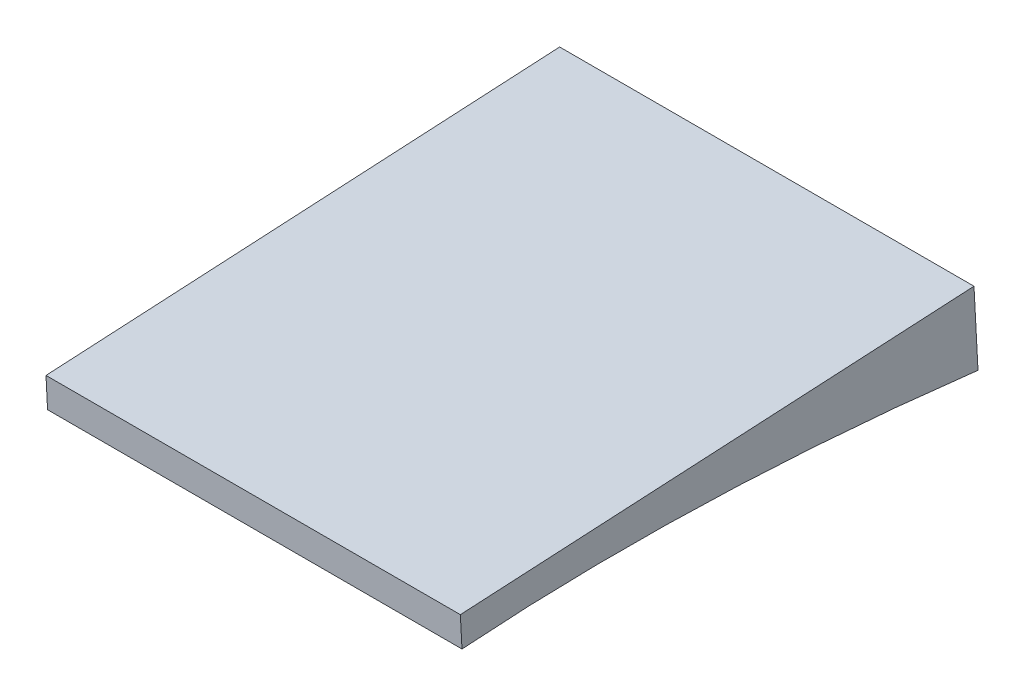
ISO-10303-21;
HEADER;
FILE_DESCRIPTION(('STEP AP214'),'2;1');
FILE_NAME('part.step','',(''),(''),'','','');
FILE_SCHEMA(('AUTOMOTIVE_DESIGN { 1 0 10303 214 1 1 1 1 }'));
ENDSEC;
DATA;
#1=APPLICATION_CONTEXT('core data for automotive mechanical design processes');
#2=APPLICATION_PROTOCOL_DEFINITION('international standard','automotive_design',2000,#1);
#3=PRODUCT_CONTEXT('',#1,'mechanical');
#4=PRODUCT('Part','Part','',(#3));
#5=PRODUCT_RELATED_PRODUCT_CATEGORY('part','',(#4));
#6=PRODUCT_DEFINITION_FORMATION('','',#4);
#7=PRODUCT_DEFINITION_CONTEXT('part definition',#1,'design');
#8=PRODUCT_DEFINITION('design','',#6,#7);
#9=PRODUCT_DEFINITION_SHAPE('','',#8);
#10=(LENGTH_UNIT() NAMED_UNIT(*) SI_UNIT(.MILLI.,.METRE.));
#11=(NAMED_UNIT(*) PLANE_ANGLE_UNIT() SI_UNIT($,.RADIAN.));
#12=(NAMED_UNIT(*) SI_UNIT($,.STERADIAN.) SOLID_ANGLE_UNIT());
#13=UNCERTAINTY_MEASURE_WITH_UNIT(LENGTH_MEASURE(1.E-05),#10,'distance_accuracy_value','');
#14=(GEOMETRIC_REPRESENTATION_CONTEXT(3) GLOBAL_UNCERTAINTY_ASSIGNED_CONTEXT((#13)) GLOBAL_UNIT_ASSIGNED_CONTEXT((#10,
#11,#12)) REPRESENTATION_CONTEXT('',''));
#15=CARTESIAN_POINT('',(0.,0.,0.));
#16=DIRECTION('',(0.,0.,1.));
#17=DIRECTION('',(1.,0.,0.));
#18=AXIS2_PLACEMENT_3D('',#15,#16,#17);
#19=CARTESIAN_POINT('',(-177.805848873745,-43.688210722732,-115.550179040921));
#20=DIRECTION('',(-2.29475219963646E-07,0.0534934907984705,-0.998568198192863));
#21=DIRECTION('',(0.,0.99856819819289,0.053493490798472));
#22=AXIS2_PLACEMENT_3D('',#19,#20,#21);
#23=PLANE('',#22);
#24=CARTESIAN_POINT('',(-177.8,74.4222867999415,-109.222976930415));
#25=CARTESIAN_POINT('',(-204.737386779382,74.4223060552666,-109.222969708578));
#26=CARTESIAN_POINT('',(-231.674773558716,74.4222945833738,-109.222964132803));
#27=CARTESIAN_POINT('',(-285.549547117384,74.4222101851525,-109.22295627338));
#28=CARTESIAN_POINT('',(-312.486933896718,74.4221372588239,-109.222953989731));
#29=CARTESIAN_POINT('',(-339.424320676004,74.4220336052774,-109.222953352146));
#30=B_SPLINE_CURVE_WITH_KNOTS('',3,(#24,#25,#26,#27,#28,#29),.UNSPECIFIED.,.F.,.F.,(4,2,4),(0.,
80.8121603380111,161.62432067631),.UNSPECIFIED.);
#31=CARTESIAN_POINT('',(-177.8,74.4222867999415,-109.222976930415));
#32=VERTEX_POINT('',#31);
#33=CARTESIAN_POINT('',(-338.178267081434,74.4220392812835,-109.222953334429));
#34=VERTEX_POINT('',#33);
#35=EDGE_CURVE('E105',#32,#34,#30,.T.);
#36=ORIENTED_EDGE('',*,*,#35,.T.);
#37=DIRECTION('',(0.0023746530409731,0.998565382766486,0.0534933394298316));
#38=VECTOR('',#37,1.);
#39=CARTESIAN_POINT('',(-338.458234976646,-43.3072641668652,-115.529734741914));
#40=LINE('',#39,#38);
#41=CARTESIAN_POINT('',(-338.20642601368,62.5809262970695,-109.857284032272));
#42=VERTEX_POINT('',#41);
#43=EDGE_CURVE('E11',#42,#34,#40,.T.);
#44=ORIENTED_EDGE('',*,*,#43,.F.);
#45=CARTESIAN_POINT('',(-339.424320676004,62.5809262763675,-109.857283753503));
#46=CARTESIAN_POINT('',(-285.549547117336,62.5809271921398,-109.857296085097));
#47=CARTESIAN_POINT('',(-231.674773558668,62.5809281079121,-109.857308416692));
#48=CARTESIAN_POINT('',(-177.8,62.5809290236845,-109.857320748286));
#49=B_SPLINE_CURVE_WITH_KNOTS('',3,(#45,#46,#47,#48),.UNSPECIFIED.,.F.,.F.,(4,4),(0.,
161.624320676009),.UNSPECIFIED.);
#50=CARTESIAN_POINT('',(-177.8,62.5809290234087,-109.857320744572));
#51=VERTEX_POINT('',#50);
#52=EDGE_CURVE('E103',#42,#51,#49,.T.);
#53=ORIENTED_EDGE('',*,*,#52,.T.);
#54=DIRECTION('',(0.,-0.99856819819289,-0.053493490798472));
#55=VECTOR('',#54,1.);
#56=CARTESIAN_POINT('',(-177.8,6.04731605634461,-112.885837288814));
#57=LINE('',#56,#55);
#58=EDGE_CURVE('E90',#32,#51,#57,.T.);
#59=ORIENTED_EDGE('',*,*,#58,.F.);
#60=EDGE_LOOP('',(#36,#44,#53,#59));
#61=FACE_BOUND('',#60,.T.);
#62=ADVANCED_FACE('F42',(#61),#23,.F.);
#63=CARTESIAN_POINT('',(-177.805940246243,-33.0381702413849,-314.355519034823));
#64=DIRECTION('',(-2.29475219526301E-07,0.0534934907984705,-0.998568198192863));
#65=DIRECTION('',(0.,0.99856819819289,0.053493490798472));
#66=AXIS2_PLACEMENT_3D('',#63,#64,#65);
#67=PLANE('',#66);
#68=CARTESIAN_POINT('',(-177.8,85.110750331542,-308.026258594133));
#69=CARTESIAN_POINT('',(-204.737394348035,85.1107449085178,-308.026252694317));
#70=CARTESIAN_POINT('',(-231.674788696068,85.1107454911889,-308.026246472776));
#71=CARTESIAN_POINT('',(-285.549577392135,85.1107586679218,-308.02623338624));
#72=CARTESIAN_POINT('',(-312.486971740168,85.1107712619836,-308.026226521246));
#73=CARTESIAN_POINT('',(-339.4243660882,85.1107898617407,-308.026219334526));
#74=B_SPLINE_CURVE_WITH_KNOTS('',3,(#68,#69,#70,#71,#72,#73),.UNSPECIFIED.,.F.,.F.,(4,2,4),(0.,
80.8121830441022,161.624366088213),.UNSPECIFIED.);
#75=CARTESIAN_POINT('',(-177.8,85.110750331542,-308.026258594133));
#76=VERTEX_POINT('',#75);
#77=CARTESIAN_POINT('',(-338.178220714968,85.1107887697366,-308.026219679411));
#78=VERTEX_POINT('',#77);
#79=EDGE_CURVE('E70',#76,#78,#74,.T.);
#80=ORIENTED_EDGE('',*,*,#79,.F.);
#81=DIRECTION('',(0.,-0.99856819819289,-0.053493490798472));
#82=VECTOR('',#81,1.);
#83=CARTESIAN_POINT('',(-177.8,16.697356429359,-311.691177288541));
#84=LINE('',#83,#82);
#85=CARTESIAN_POINT('',(-177.8,56.1511791040107,-309.577628401668));
#86=VERTEX_POINT('',#85);
#87=EDGE_CURVE('E100',#76,#86,#84,.T.);
#88=ORIENTED_EDGE('',*,*,#87,.T.);
#89=CARTESIAN_POINT('',(-339.4243660882,56.15118359318,-309.577591022767));
#90=CARTESIAN_POINT('',(-285.549577392133,56.1511820966472,-309.577603483592));
#91=CARTESIAN_POINT('',(-231.674788696067,56.1511806001143,-309.577615944417));
#92=CARTESIAN_POINT('',(-177.8,56.1511791035814,-309.577628405242));
#93=B_SPLINE_CURVE_WITH_KNOTS('',3,(#89,#90,#91,#92),.UNSPECIFIED.,.F.,.F.,(4,4),(0.,
161.624366088204),.UNSPECIFIED.);
#94=CARTESIAN_POINT('',(-338.247088528495,56.1511835604797,-309.577591295045));
#95=VERTEX_POINT('',#94);
#96=EDGE_CURVE('E63',#95,#86,#93,.T.);
#97=ORIENTED_EDGE('',*,*,#96,.F.);
#98=DIRECTION('',(0.0023746530409731,0.998565382766486,0.0534933394298316));
#99=VECTOR('',#98,1.);
#100=CARTESIAN_POINT('',(-338.458280662959,-32.6572237938514,-314.335074741631));
#101=LINE('',#100,#99);
#102=EDGE_CURVE('E106',#95,#78,#101,.T.);
#103=ORIENTED_EDGE('',*,*,#102,.T.);
#104=EDGE_LOOP('',(#80,#88,#97,#103));
#105=FACE_BOUND('',#104,.T.);
#106=ADVANCED_FACE('F141',(#105),#67,.T.);
#107=CARTESIAN_POINT('',(-338.458280662959,-32.6572237938514,-314.335074741631));
#108=DIRECTION('',(-0.999997180507466,0.0023712407330619,0.000127257626607295));
#109=DIRECTION('',(-0.00237124075226243,-0.999997188604695,0.));
#110=AXIS2_PLACEMENT_3D('',#107,#108,#109);
#111=PLANE('',#110);
#112=CARTESIAN_POINT('',(-338.178219534104,85.3830238830238,-313.089602884485));
#113=CARTESIAN_POINT('',(-338.178235622091,81.6742972710218,-244.109881178541));
#114=CARTESIAN_POINT('',(-338.178251710078,77.9655706590198,-175.130159472598));
#115=CARTESIAN_POINT('',(-338.178267798066,74.2568440470178,-106.150437766654));
#116=B_SPLINE_CURVE_WITH_KNOTS('',3,(#112,#113,#114,#115),.UNSPECIFIED.,.F.,.F.,(4,4),(0.,
207.238051374284),.UNSPECIFIED.);
#117=EDGE_CURVE('E99',#78,#34,#116,.T.);
#118=ORIENTED_EDGE('',*,*,#117,.F.);
#119=ORIENTED_EDGE('',*,*,#102,.F.);
#120=CARTESIAN_POINT('',(-338.206629307986,62.2962575237652,-106.150437766655));
#121=CARTESIAN_POINT('',(-338.206453969641,62.5247401456622,-109.030025096472));
#122=CARTESIAN_POINT('',(-338.206319362698,62.7361174881108,-111.910952636639));
#123=CARTESIAN_POINT('',(-338.206128434088,63.1259754653098,-117.675000443193));
#124=CARTESIAN_POINT('',(-338.206072111478,63.3044564959485,-120.558120682773));
#125=CARTESIAN_POINT('',(-338.206034601137,63.6295707101727,-126.321341736812));
#126=CARTESIAN_POINT('',(-338.206053288673,63.7762563380622,-129.201439604374));
#127=CARTESIAN_POINT('',(-338.206162611212,64.0393605017619,-134.963023879365));
#128=CARTESIAN_POINT('',(-338.206253246452,64.1557789377871,-137.84451029134));
#129=CARTESIAN_POINT('',(-338.206504078547,64.3591537614888,-143.605124198442));
#130=CARTESIAN_POINT('',(-338.206664193418,64.4461446581661,-146.484250479201));
#131=CARTESIAN_POINT('',(-338.207051628979,64.5918225911671,-152.243213123843));
#132=CARTESIAN_POINT('',(-338.207278949606,64.650509654342,-155.123049487049));
#133=CARTESIAN_POINT('',(-338.207798279662,64.7405057822875,-160.880905386172));
#134=CARTESIAN_POINT('',(-338.208090238618,64.7718361147902,-163.758924592152));
#135=CARTESIAN_POINT('',(-338.208736654271,64.808149125132,-169.515127494233));
#136=CARTESIAN_POINT('',(-338.209091110984,64.8131317960546,-172.393311190377));
#137=CARTESIAN_POINT('',(-338.20986071521,64.7974289572796,-178.148304930561));
#138=CARTESIAN_POINT('',(-338.210275835201,64.7767550551607,-181.025115007153));
#139=CARTESIAN_POINT('',(-338.211165230647,64.7104447015603,-186.778445051731));
#140=CARTESIAN_POINT('',(-338.211639506092,64.6648082537457,-189.654965019759));
#141=CARTESIAN_POINT('',(-338.212645489758,64.5492610073745,-195.407001351238));
#142=CARTESIAN_POINT('',(-338.213177187703,64.4793545463215,-198.282517802176));
#143=CARTESIAN_POINT('',(-338.214296400293,64.3159666365865,-204.032879383248));
#144=CARTESIAN_POINT('',(-338.214883914941,64.2224851860311,-206.907724513328));
#145=CARTESIAN_POINT('',(-338.216113256012,64.0125132651097,-212.655463593567));
#146=CARTESIAN_POINT('',(-338.216755061415,63.8960316769354,-215.528357868693));
#147=CARTESIAN_POINT('',(-338.218092028631,63.6405131774475,-221.273141831174));
#148=CARTESIAN_POINT('',(-338.218787190442,63.5014762669658,-224.145031518565));
#149=CARTESIAN_POINT('',(-338.220229959308,63.2012796699084,-229.888706129837));
#150=CARTESIAN_POINT('',(-338.220977585446,63.0401119130188,-232.760490631469));
#151=CARTESIAN_POINT('',(-338.222523883018,62.6961801173133,-238.502764386568));
#152=CARTESIAN_POINT('',(-338.223322554445,62.5134160821898,-241.373253640257));
#153=CARTESIAN_POINT('',(-338.224970311992,62.126643979006,-247.114545185989));
#154=CARTESIAN_POINT('',(-338.225819428338,61.922623117853,-249.985346615644));
#155=CARTESIAN_POINT('',(-338.227566555064,61.4938788535997,-255.725402872418));
#156=CARTESIAN_POINT('',(-338.228464565467,61.2691554398632,-258.594657698742));
#157=CARTESIAN_POINT('',(-338.23030913273,60.7992726107585,-264.333856023614));
#158=CARTESIAN_POINT('',(-338.231255728671,60.5540966406245,-267.203798167908));
#159=CARTESIAN_POINT('',(-338.232710724779,60.1714580975666,-271.507382328425));
#160=CARTESIAN_POINT('',(-338.233201574025,60.0414327706237,-272.94168937267));
#161=CARTESIAN_POINT('',(-338.234194801157,59.7764960324274,-275.809851825822));
#162=CARTESIAN_POINT('',(-338.234697179044,59.6415846209734,-277.24370723471));
#163=CARTESIAN_POINT('',(-338.236222701887,59.2292134232657,-281.547474125802));
#164=CARTESIAN_POINT('',(-338.237263254882,58.944374695877,-284.416684235686));
#165=CARTESIAN_POINT('',(-338.238860396206,58.5017179091536,-288.718909819743));
#166=CARTESIAN_POINT('',(-338.23939882944,58.3515989646189,-290.152722200165));
#167=CARTESIAN_POINT('',(-338.240488090614,58.0461039448979,-293.019787049412));
#168=CARTESIAN_POINT('',(-338.241038918546,57.8907278726794,-294.453039518553));
#169=CARTESIAN_POINT('',(-338.242153655832,57.5745193818421,-297.320668743252));
#170=CARTESIAN_POINT('',(-338.242717579977,57.4136806879988,-298.755044806094));
#171=CARTESIAN_POINT('',(-338.243856458426,57.0873231658845,-301.623265728274));
#172=CARTESIAN_POINT('',(-338.244431412743,56.9218043313883,-303.057110586903));
#173=CARTESIAN_POINT('',(-338.245591089206,56.586621179404,-305.924312025326));
#174=CARTESIAN_POINT('',(-338.246175811331,56.4169568703569,-307.357668606107));
#175=CARTESIAN_POINT('',(-338.247353721626,56.0740346171672,-310.223946787593));
#176=CARTESIAN_POINT('',(-338.247946909764,55.9007766860463,-311.656868389853));
#177=CARTESIAN_POINT('',(-338.248543681571,55.725997412325,-313.089602884485));
#178=B_SPLINE_CURVE_WITH_KNOTS('',3,(#120,#121,#122,#123,#124,#125,#126,#127,#128,#129,#130,
#131,#132,#133,#134,#135,#136,#137,#138,#139,#140,#141,#142,#143,#144,#145,#146,#147,#148,#149,
#150,#151,#152,#153,#154,#155,#156,#157,#158,#159,#160,#161,#162,#163,#164,#165,#166,#167,#168,
#169,#170,#171,#172,#173,#174,#175,#176,#177),.UNSPECIFIED.,.F.,.F.,(4,2,2,2,2,2,2,2,2,2,2,2,2,
2,2,2,2,2,2,2,2,2,2,2,2,2,2,2,4),(0.,8.66583722965497,17.3315701641344,25.9828989341352,
34.6342562255171,43.2754328114468,51.916601199687,60.551045754552,69.1854925760466,
77.8160344140491,86.4465749842524,95.0755739093694,103.704573520211,112.330247278956,
120.955920719535,129.584748024028,138.213573853306,146.847623138704,155.481676859984,
164.122788282878,168.443347008376,172.763905911103,181.413764000134,185.738705816302,
190.063645191095,194.393733114767,198.723826798448,203.053911666024,207.383980845995),.UNSPECIFIED.);
#179=EDGE_CURVE('E115',#42,#95,#178,.T.);
#180=ORIENTED_EDGE('',*,*,#179,.F.);
#181=ORIENTED_EDGE('',*,*,#43,.T.);
#182=EDGE_LOOP('',(#118,#119,#180,#181));
#183=FACE_BOUND('',#182,.T.);
#184=ADVANCED_FACE('F145',(#183),#111,.T.);
#185=CARTESIAN_POINT('',(-177.8,0.,0.));
#186=DIRECTION('',(-1.,0.,0.));
#187=DIRECTION('',(0.,0.,1.));
#188=AXIS2_PLACEMENT_3D('',#185,#186,#187);
#189=PLANE('',#188);
#190=DIRECTION('',(0.,0.0536864833252265,-0.998557840842567));
#191=VECTOR('',#190,1.);
#192=CARTESIAN_POINT('',(-177.8,65.8781508423885,49.6962411892494));
#193=LINE('',#192,#191);
#194=EDGE_CURVE('E94',#32,#76,#193,.T.);
#195=ORIENTED_EDGE('',*,*,#194,.F.);
#196=ORIENTED_EDGE('',*,*,#58,.T.);
#197=CARTESIAN_POINT('',(-177.8,-4.63504372721387,-486.265240325771));
#198=CARTESIAN_POINT('',(-177.8,1.83078834545628,-475.798604619994));
#199=CARTESIAN_POINT('',(-177.8,13.88926974822,-454.312764268715));
#200=CARTESIAN_POINT('',(-177.8,29.2245092391949,-420.690900195696));
#201=CARTESIAN_POINT('',(-177.8,39.4662975955996,-391.639559871781));
#202=CARTESIAN_POINT('',(-177.8,46.0383471864307,-367.906811920152));
#203=CARTESIAN_POINT('',(-177.8,50.1289716166113,-349.897665028212));
#204=CARTESIAN_POINT('',(-177.8,53.3958988659329,-331.712828111795));
#205=CARTESIAN_POINT('',(-177.8,55.714700607055,-313.408651411274));
#206=CARTESIAN_POINT('',(-177.8,57.8672725021249,-295.107197371007));
#207=CARTESIAN_POINT('',(-177.8,60.3514671040502,-270.6545199273));
#208=CARTESIAN_POINT('',(-177.8,62.7920862835124,-240.027554240449));
#209=CARTESIAN_POINT('',(-177.8,64.5518412881872,-203.195919164225));
#210=CARTESIAN_POINT('',(-177.8,65.0284962278422,-166.320848877817));
#211=CARTESIAN_POINT('',(-177.8,64.0618587849313,-129.448182963541));
#212=CARTESIAN_POINT('',(-177.8,61.4272131768156,-92.6473789600514));
#213=CARTESIAN_POINT('',(-177.8,57.5903132654066,-62.1278910615713));
#214=CARTESIAN_POINT('',(-177.8,53.2997551007173,-37.896239171482));
#215=CARTESIAN_POINT('',(-177.8,49.3855068860328,-19.8527900849958));
#216=CARTESIAN_POINT('',(-177.8,44.6602421800703,-1.99498265798601));
#217=CARTESIAN_POINT('',(-177.8,39.9109380351398,12.6617143775167));
#218=CARTESIAN_POINT('',(-177.8,35.489238489374,24.1743679264121));
#219=CARTESIAN_POINT('',(-177.8,31.8084283862062,32.6687242753332));
#220=CARTESIAN_POINT('',(-177.8,27.6918547943622,40.974488962412));
#221=CARTESIAN_POINT('',(-177.8,23.0319323917029,49.0126857131575));
#222=CARTESIAN_POINT('',(-177.8,17.6580792712106,56.6339395967455));
#223=CARTESIAN_POINT('',(-177.8,12.3453248319818,62.404116232879));
#224=CARTESIAN_POINT('',(-177.8,7.32735483393856,66.2701140204816));
#225=CARTESIAN_POINT('',(-177.8,3.09941750836411,68.5714980011858));
#226=CARTESIAN_POINT('',(-177.8,-0.452354776864283,69.5610109929074));
#227=CARTESIAN_POINT('',(-177.8,-2.88445310451718,69.7917971271235));
#228=CARTESIAN_POINT('',(-177.8,-4.12527062577326,69.8176285587099));
#229=CARTESIAN_POINT('',(-177.8,-5.36659154709746,69.7196954311463));
#230=CARTESIAN_POINT('',(-177.8,-6.13001958673486,69.6175918349424));
#231=CARTESIAN_POINT('',(-177.8,-6.51913907058263,69.5663617744474));
#232=B_SPLINE_CURVE_WITH_KNOTS('',3,(#197,#198,#199,#200,#201,#202,#203,#204,#205,#206,#207,
#208,#209,#210,#211,#212,#213,#214,#215,#216,#217,#218,#219,#220,#221,#222,#223,#224,#225,#226,
#227,#228,#229,#230,#231),.UNSPECIFIED.,.F.,.F.,(4,1,1,1,1,1,1,1,1,1,1,1,1,1,1,1,1,1,1,1,1,1,1,
1,1,1,1,1,1,1,1,1,4),(0.,0.0625041235375069,0.125008247075014,0.187512370612521,
0.218764432381274,0.250016494150027,0.281268555918781,0.312520617687534,0.343772679456288,
0.375024741225041,0.437528864762549,0.500032988300055,0.562537111837562,0.625041235375069,
0.687545358912576,0.750049482450083,0.781301544218836,0.81255360598759,0.843805667756343,
0.875057729525097,0.890683760409473,0.90630979129385,0.921935822178227,0.937561853062603,
0.95318788394698,0.968813914831357,0.976626930273545,0.984439945715734,0.992252961157922,
0.994206215018469,0.996159468879016,0.998112722739563,1.00006597660011),.UNSPECIFIED.);
#233=EDGE_CURVE('E47',#86,#51,#232,.T.);
#234=ORIENTED_EDGE('',*,*,#233,.F.);
#235=ORIENTED_EDGE('',*,*,#87,.F.);
#236=EDGE_LOOP('',(#195,#196,#234,#235));
#237=FACE_BOUND('',#236,.T.);
#238=ADVANCED_FACE('F92',(#237),#189,.F.);
#239=DIRECTION('',(-1.,0.,0.));
#240=VECTOR('',#239,1.);
#241=SURFACE_OF_LINEAR_EXTRUSION('',#232,#240);
#242=ORIENTED_EDGE('',*,*,#52,.F.);
#243=ORIENTED_EDGE('',*,*,#179,.T.);
#244=ORIENTED_EDGE('',*,*,#96,.T.);
#245=ORIENTED_EDGE('',*,*,#233,.T.);
#246=EDGE_LOOP('',(#242,#243,#244,#245));
#247=FACE_BOUND('',#246,.T.);
#248=ADVANCED_FACE('F44',(#247),#241,.T.);
#249=CARTESIAN_POINT('',(-177.8,65.8781508423885,49.6962411892493));
#250=CARTESIAN_POINT('',(-231.516137288527,65.8787970451198,49.684221947819));
#251=CARTESIAN_POINT('',(-328.898817793057,65.8799587745919,49.6624290270975));
#252=CARTESIAN_POINT('',(-430.301749554133,65.8795676334247,49.6392318840312));
#253=CARTESIAN_POINT('',(-478.536378495178,65.8944796643632,49.6329561991434));
#254=CARTESIAN_POINT('',(-484.553750526313,65.8801569539115,49.62707278082));
#255=CARTESIAN_POINT('',(-485.331531687459,65.8700020364117,49.6236952041893));
#256=CARTESIAN_POINT('',(-485.744527490584,65.8838878926665,49.627977729598));
#257=CARTESIAN_POINT('',(-486.040270716771,65.8993784286855,49.6327926933882));
#258=CARTESIAN_POINT('',(-486.556396633948,65.9602372100236,49.651856532687));
#259=CARTESIAN_POINT('',(-487.317873690559,66.0137555468449,49.6685510047104));
#260=CARTESIAN_POINT('',(-488.239730119881,66.0950282411789,49.6939565152748));
#261=CARTESIAN_POINT('',(-489.559339697561,66.2103395815435,49.7299997134027));
#262=CARTESIAN_POINT('',(-490.486101932218,66.2905952519518,49.7550835652258));
#263=CARTESIAN_POINT('',(-491.107536578648,66.3445114865218,49.7719353115469));
#264=CARTESIAN_POINT('',(-177.8,74.6548216331163,-113.548078269781));
#265=CARTESIAN_POINT('',(-231.579974335744,74.655252434937,-113.556091097401));
#266=CARTESIAN_POINT('',(-329.085323869404,74.6560228824289,-113.570620546676));
#267=CARTESIAN_POINT('',(-430.425747152048,74.6560404333492,-113.586027737782));
#268=CARTESIAN_POINT('',(-478.552015447206,74.6690366969826,-113.589579595877));
#269=CARTESIAN_POINT('',(-484.557146346177,74.6551946697141,-113.594390029726));
#270=CARTESIAN_POINT('',(-485.334083909181,74.6445154674445,-113.597450407754));
#271=CARTESIAN_POINT('',(-485.744700304045,74.6598119040633,-113.593346135502));
#272=CARTESIAN_POINT('',(-486.032139732393,74.6761191709517,-113.588899099885));
#273=CARTESIAN_POINT('',(-486.482546738094,74.7359898087317,-113.572197908095));
#274=CARTESIAN_POINT('',(-487.138956506633,74.7871913881035,-113.55785727129));
#275=CARTESIAN_POINT('',(-487.922810441756,74.8606870318585,-113.536925044651));
#276=CARTESIAN_POINT('',(-489.038035338706,74.9653658189383,-113.507144656348));
#277=CARTESIAN_POINT('',(-489.817904728499,75.0386262870922,-113.486335263897));
#278=CARTESIAN_POINT('',(-490.341175821834,75.0877184236467,-113.472381004376));
#279=CARTESIAN_POINT('',(-177.8,83.4314924238441,-276.792397728811));
#280=CARTESIAN_POINT('',(-231.64381138296,83.4317078247542,-276.79640414262));
#281=CARTESIAN_POINT('',(-329.271829945751,83.4320869902656,-276.80367012045));
#282=CARTESIAN_POINT('',(-430.549744749963,83.4325132332734,-276.811287359595));
#283=CARTESIAN_POINT('',(-478.567652399233,83.4435937296021,-276.812115390897));
#284=CARTESIAN_POINT('',(-484.560542166041,83.4302323855168,-276.815852840272));
#285=CARTESIAN_POINT('',(-485.336636130903,83.4190288984773,-276.818596019698));
#286=CARTESIAN_POINT('',(-485.744873117508,83.4357359154601,-276.814670000602));
#287=CARTESIAN_POINT('',(-486.024008748016,83.452859913218,-276.810590893159));
#288=CARTESIAN_POINT('',(-486.408696842241,83.5117424074398,-276.796252348878));
#289=CARTESIAN_POINT('',(-486.960039322706,83.5606272293622,-276.784265547289));
#290=CARTESIAN_POINT('',(-487.605890763631,83.6263458225381,-276.767806604576));
#291=CARTESIAN_POINT('',(-488.51673097985,83.7203920563331,-276.744289026098));
#292=CARTESIAN_POINT('',(-489.14970752478,83.7866573222327,-276.72775409302));
#293=CARTESIAN_POINT('',(-489.57481506502,83.8309253607717,-276.716697320298));
#294=CARTESIAN_POINT('',(-177.8,92.2081632145719,-440.036717187841));
#295=CARTESIAN_POINT('',(-231.707648430177,92.2081632145713,-440.03671718784));
#296=CARTESIAN_POINT('',(-329.458336022097,92.2081510981023,-440.036719694223));
#297=CARTESIAN_POINT('',(-430.673742347878,92.2089860331975,-440.036546981408));
#298=CARTESIAN_POINT('',(-478.58328935126,92.2181507622215,-440.034651185918));
#299=CARTESIAN_POINT('',(-484.563937985906,92.2052701013194,-440.037315650818));
#300=CARTESIAN_POINT('',(-485.339188352625,92.1935423295101,-440.039741631642));
#301=CARTESIAN_POINT('',(-485.74504593097,92.211659926857,-440.035993865702));
#302=CARTESIAN_POINT('',(-486.015877763639,92.2296006554842,-440.032282686432));
#303=CARTESIAN_POINT('',(-486.334846946387,92.2874950061478,-440.02030678966));
#304=CARTESIAN_POINT('',(-486.781122138779,92.3340630706208,-440.010673823289));
#305=CARTESIAN_POINT('',(-487.288971085506,92.3920046132177,-439.998688164502));
#306=CARTESIAN_POINT('',(-487.995426620994,92.4754182937279,-439.981433395848));
#307=CARTESIAN_POINT('',(-488.481510321061,92.5346883573731,-439.969172922142));
#308=CARTESIAN_POINT('',(-488.808454308207,92.5741322978967,-439.961013636221));
#309=B_SPLINE_SURFACE_WITH_KNOTS('',3,3,((#249,#250,#251,#252,#253,#254,#255,#256,#257,#258,
#259,#260,#261,#262,#263),(#264,#265,#266,#267,#268,#269,#270,#271,#272,#273,#274,#275,#276,
#277,#278),(#279,#280,#281,#282,#283,#284,#285,#286,#287,#288,#289,#290,#291,#292,#293),(#294,
#295,#296,#297,#298,#299,#300,#301,#302,#303,#304,#305,#306,#307,#308)),.UNSPECIFIED.,.F.,.F.,
.F.,(4,4),(4,1,1,1,1,1,1,1,1,1,1,1,4),(0.,1.),(0.,0.5,0.90625,0.95703125,0.9609375,0.9638671875,
0.96450845898134,0.96484375,0.966796875,0.970703125,0.9765625,0.984375,1.),.UNSPECIFIED.);
#310=ORIENTED_EDGE('',*,*,#35,.F.);
#311=ORIENTED_EDGE('',*,*,#194,.T.);
#312=ORIENTED_EDGE('',*,*,#79,.T.);
#313=ORIENTED_EDGE('',*,*,#117,.T.);
#314=EDGE_LOOP('',(#310,#311,#312,#313));
#315=FACE_BOUND('',#314,.T.);
#316=ADVANCED_FACE('F136',(#315),#309,.T.);
#317=CLOSED_SHELL('',(#62,#106,#184,#238,#248,#316));
#318=MANIFOLD_SOLID_BREP('B2',#317);
#319=ADVANCED_BREP_SHAPE_REPRESENTATION('',(#18,#318),#14);
#320=SHAPE_DEFINITION_REPRESENTATION(#9,#319);
ENDSEC;
END-ISO-10303-21;
